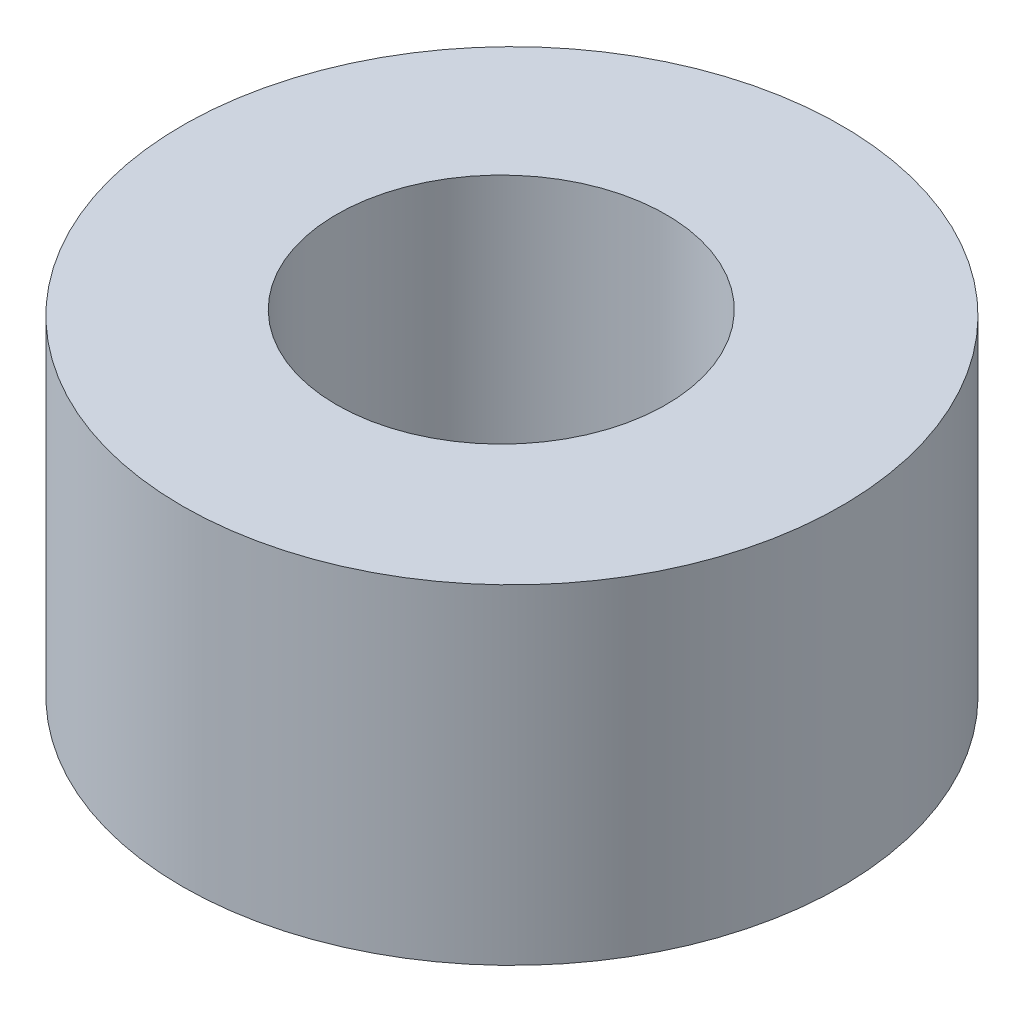
ISO-10303-21;
HEADER;
FILE_DESCRIPTION(('STEP AP214'),'2;1');
FILE_NAME('part.step','',(''),(''),'','','');
FILE_SCHEMA(('AUTOMOTIVE_DESIGN { 1 0 10303 214 1 1 1 1 }'));
ENDSEC;
DATA;
#1=APPLICATION_CONTEXT('core data for automotive mechanical design processes');
#2=APPLICATION_PROTOCOL_DEFINITION('international standard','automotive_design',2000,#1);
#3=PRODUCT_CONTEXT('',#1,'mechanical');
#4=PRODUCT('Part','Part','',(#3));
#5=PRODUCT_RELATED_PRODUCT_CATEGORY('part','',(#4));
#6=PRODUCT_DEFINITION_FORMATION('','',#4);
#7=PRODUCT_DEFINITION_CONTEXT('part definition',#1,'design');
#8=PRODUCT_DEFINITION('design','',#6,#7);
#9=PRODUCT_DEFINITION_SHAPE('','',#8);
#10=(LENGTH_UNIT() NAMED_UNIT(*) SI_UNIT(.MILLI.,.METRE.));
#11=(NAMED_UNIT(*) PLANE_ANGLE_UNIT() SI_UNIT($,.RADIAN.));
#12=(NAMED_UNIT(*) SI_UNIT($,.STERADIAN.) SOLID_ANGLE_UNIT());
#13=UNCERTAINTY_MEASURE_WITH_UNIT(LENGTH_MEASURE(1.E-05),#10,'distance_accuracy_value','');
#14=(GEOMETRIC_REPRESENTATION_CONTEXT(3) GLOBAL_UNCERTAINTY_ASSIGNED_CONTEXT((#13)) GLOBAL_UNIT_ASSIGNED_CONTEXT((#10,
#11,#12)) REPRESENTATION_CONTEXT('',''));
#15=CARTESIAN_POINT('',(0.,0.,0.));
#16=DIRECTION('',(0.,0.,1.));
#17=DIRECTION('',(1.,0.,0.));
#18=AXIS2_PLACEMENT_3D('',#15,#16,#17);
#19=CARTESIAN_POINT('',(0.,12.7,0.));
#20=DIRECTION('',(0.,1.,0.));
#21=DIRECTION('',(0.,0.,1.));
#22=AXIS2_PLACEMENT_3D('',#19,#20,#21);
#23=PLANE('',#22);
#24=CARTESIAN_POINT('',(0.,12.7,0.));
#25=DIRECTION('',(0.,1.,0.));
#26=DIRECTION('',(0.,0.,1.));
#27=AXIS2_PLACEMENT_3D('',#24,#25,#26);
#28=CIRCLE('',#27,12.7);
#29=CARTESIAN_POINT('',(0.,12.7,12.7));
#30=VERTEX_POINT('',#29);
#31=EDGE_CURVE('E10',#30,#30,#28,.T.);
#32=ORIENTED_EDGE('',*,*,#31,.T.);
#33=EDGE_LOOP('',(#32));
#34=FACE_BOUND('',#33,.T.);
#35=CARTESIAN_POINT('',(-0.411574074074072,12.7,0.));
#36=DIRECTION('',(0.,1.,0.));
#37=DIRECTION('',(0.,0.,1.));
#38=AXIS2_PLACEMENT_3D('',#35,#36,#37);
#39=CIRCLE('',#38,6.35);
#40=CARTESIAN_POINT('',(-0.411574074074072,12.7,6.35));
#41=VERTEX_POINT('',#40);
#42=EDGE_CURVE('E46',#41,#41,#39,.T.);
#43=ORIENTED_EDGE('',*,*,#42,.F.);
#44=EDGE_LOOP('',(#43));
#45=FACE_BOUND('',#44,.T.);
#46=ADVANCED_FACE('F35',(#34,#45),#23,.T.);
#47=CARTESIAN_POINT('',(0.,0.,0.));
#48=DIRECTION('',(0.,1.,0.));
#49=DIRECTION('',(0.,0.,1.));
#50=AXIS2_PLACEMENT_3D('',#47,#48,#49);
#51=PLANE('',#50);
#52=CARTESIAN_POINT('',(0.,0.,0.));
#53=DIRECTION('',(0.,1.,0.));
#54=DIRECTION('',(0.,0.,1.));
#55=AXIS2_PLACEMENT_3D('',#52,#53,#54);
#56=CIRCLE('',#55,12.7);
#57=CARTESIAN_POINT('',(0.,0.,12.7));
#58=VERTEX_POINT('',#57);
#59=EDGE_CURVE('E39',#58,#58,#56,.T.);
#60=ORIENTED_EDGE('',*,*,#59,.F.);
#61=EDGE_LOOP('',(#60));
#62=FACE_BOUND('',#61,.T.);
#63=CARTESIAN_POINT('',(-0.411574074074072,0.,0.));
#64=DIRECTION('',(0.,1.,0.));
#65=DIRECTION('',(0.,0.,1.));
#66=AXIS2_PLACEMENT_3D('',#63,#64,#65);
#67=CIRCLE('',#66,6.35);
#68=CARTESIAN_POINT('',(-0.411574074074072,0.,6.35));
#69=VERTEX_POINT('',#68);
#70=EDGE_CURVE('E48',#69,#69,#67,.T.);
#71=ORIENTED_EDGE('',*,*,#70,.T.);
#72=EDGE_LOOP('',(#71));
#73=FACE_BOUND('',#72,.T.);
#74=ADVANCED_FACE('F58',(#62,#73),#51,.F.);
#75=CARTESIAN_POINT('',(0.,12.7,0.));
#76=DIRECTION('',(0.,-1.,0.));
#77=DIRECTION('',(0.,0.,-1.));
#78=AXIS2_PLACEMENT_3D('',#75,#76,#77);
#79=CYLINDRICAL_SURFACE('',#78,12.7);
#80=ORIENTED_EDGE('',*,*,#31,.F.);
#81=EDGE_LOOP('',(#80));
#82=FACE_BOUND('',#81,.T.);
#83=ORIENTED_EDGE('',*,*,#59,.T.);
#84=EDGE_LOOP('',(#83));
#85=FACE_BOUND('',#84,.T.);
#86=ADVANCED_FACE('F37',(#82,#85),#79,.T.);
#87=CARTESIAN_POINT('',(-0.411574074074072,12.7,0.));
#88=DIRECTION('',(0.,-1.,0.));
#89=DIRECTION('',(0.,0.,-1.));
#90=AXIS2_PLACEMENT_3D('',#87,#88,#89);
#91=CYLINDRICAL_SURFACE('',#90,6.35);
#92=ORIENTED_EDGE('',*,*,#42,.T.);
#93=EDGE_LOOP('',(#92));
#94=FACE_BOUND('',#93,.T.);
#95=ORIENTED_EDGE('',*,*,#70,.F.);
#96=EDGE_LOOP('',(#95));
#97=FACE_BOUND('',#96,.T.);
#98=ADVANCED_FACE('F54',(#94,#97),#91,.F.);
#99=CLOSED_SHELL('',(#46,#74,#86,#98));
#100=MANIFOLD_SOLID_BREP('B2',#99);
#101=ADVANCED_BREP_SHAPE_REPRESENTATION('',(#18,#100),#14);
#102=SHAPE_DEFINITION_REPRESENTATION(#9,#101);
ENDSEC;
END-ISO-10303-21;
